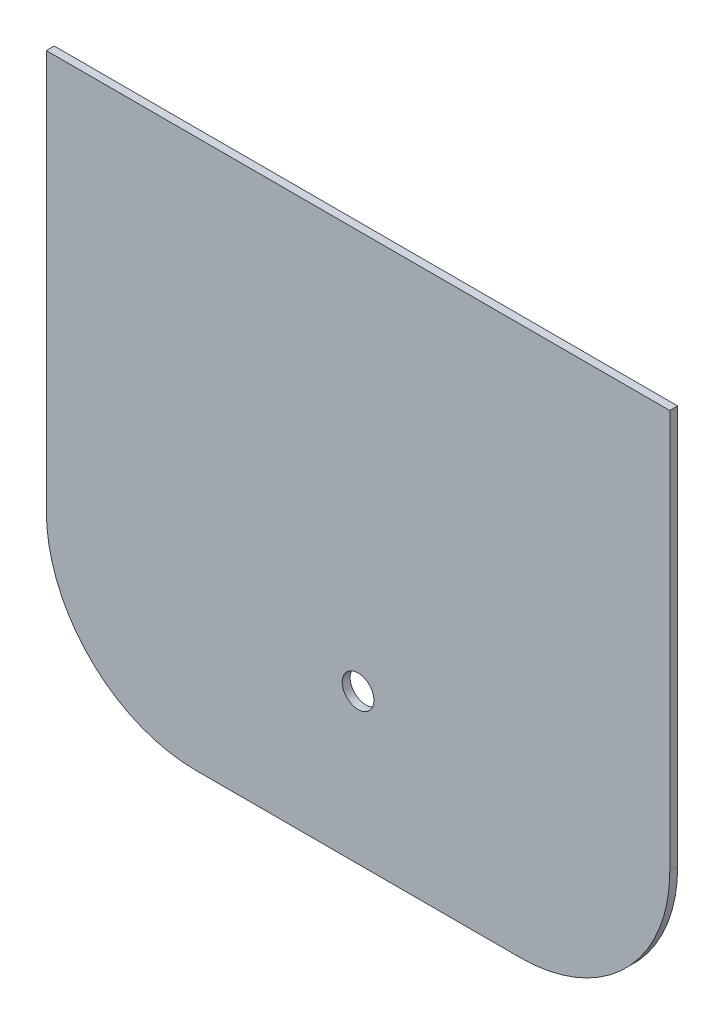
ISO-10303-21;
HEADER;
FILE_DESCRIPTION(('STEP AP214'),'2;1');
FILE_NAME('part.step','',(''),(''),'','','');
FILE_SCHEMA(('AUTOMOTIVE_DESIGN { 1 0 10303 214 1 1 1 1 }'));
ENDSEC;
DATA;
#1=APPLICATION_CONTEXT('core data for automotive mechanical design processes');
#2=APPLICATION_PROTOCOL_DEFINITION('international standard','automotive_design',2000,#1);
#3=PRODUCT_CONTEXT('',#1,'mechanical');
#4=PRODUCT('Part','Part','',(#3));
#5=PRODUCT_RELATED_PRODUCT_CATEGORY('part','',(#4));
#6=PRODUCT_DEFINITION_FORMATION('','',#4);
#7=PRODUCT_DEFINITION_CONTEXT('part definition',#1,'design');
#8=PRODUCT_DEFINITION('design','',#6,#7);
#9=PRODUCT_DEFINITION_SHAPE('','',#8);
#10=(LENGTH_UNIT() NAMED_UNIT(*) SI_UNIT(.MILLI.,.METRE.));
#11=(NAMED_UNIT(*) PLANE_ANGLE_UNIT() SI_UNIT($,.RADIAN.));
#12=(NAMED_UNIT(*) SI_UNIT($,.STERADIAN.) SOLID_ANGLE_UNIT());
#13=UNCERTAINTY_MEASURE_WITH_UNIT(LENGTH_MEASURE(1.E-05),#10,'distance_accuracy_value','');
#14=(GEOMETRIC_REPRESENTATION_CONTEXT(3) GLOBAL_UNCERTAINTY_ASSIGNED_CONTEXT((#13)) GLOBAL_UNIT_ASSIGNED_CONTEXT((#10,
#11,#12)) REPRESENTATION_CONTEXT('',''));
#15=CARTESIAN_POINT('',(0.,0.,0.));
#16=DIRECTION('',(0.,0.,1.));
#17=DIRECTION('',(1.,0.,0.));
#18=AXIS2_PLACEMENT_3D('',#15,#16,#17);
#19=CARTESIAN_POINT('',(0.,0.,3.175));
#20=DIRECTION('',(1.,0.,0.));
#21=DIRECTION('',(0.,0.,-1.));
#22=AXIS2_PLACEMENT_3D('',#19,#20,#21);
#23=PLANE('',#22);
#24=DIRECTION('',(0.,-1.,0.));
#25=VECTOR('',#24,1.);
#26=CARTESIAN_POINT('',(0.,0.,0.));
#27=LINE('',#26,#25);
#28=CARTESIAN_POINT('',(0.,220.,0.));
#29=VERTEX_POINT('',#28);
#30=CARTESIAN_POINT('',(0.,60.,0.));
#31=VERTEX_POINT('',#30);
#32=EDGE_CURVE('E120',#29,#31,#27,.T.);
#33=ORIENTED_EDGE('',*,*,#32,.T.);
#34=DIRECTION('',(0.,0.,-1.));
#35=VECTOR('',#34,1.);
#36=CARTESIAN_POINT('',(0.,60.,3.175));
#37=LINE('',#36,#35);
#38=CARTESIAN_POINT('',(0.,60.,3.175));
#39=VERTEX_POINT('',#38);
#40=EDGE_CURVE('E11',#31,#39,#37,.F.);
#41=ORIENTED_EDGE('',*,*,#40,.T.);
#42=DIRECTION('',(0.,-1.,0.));
#43=VECTOR('',#42,1.);
#44=CARTESIAN_POINT('',(0.,0.,3.175));
#45=LINE('',#44,#43);
#46=CARTESIAN_POINT('',(0.,220.,3.175));
#47=VERTEX_POINT('',#46);
#48=EDGE_CURVE('E126',#47,#39,#45,.T.);
#49=ORIENTED_EDGE('',*,*,#48,.F.);
#50=DIRECTION('',(0.,0.,-1.));
#51=VECTOR('',#50,1.);
#52=CARTESIAN_POINT('',(0.,220.,3.175));
#53=LINE('',#52,#51);
#54=EDGE_CURVE('E112',#47,#29,#53,.T.);
#55=ORIENTED_EDGE('',*,*,#54,.T.);
#56=EDGE_LOOP('',(#33,#41,#49,#55));
#57=FACE_BOUND('',#56,.T.);
#58=ADVANCED_FACE('F37',(#57),#23,.F.);
#59=CARTESIAN_POINT('',(0.,0.,3.175));
#60=DIRECTION('',(0.,1.,0.));
#61=DIRECTION('',(0.,0.,1.));
#62=AXIS2_PLACEMENT_3D('',#59,#60,#61);
#63=PLANE('',#62);
#64=DIRECTION('',(1.,0.,0.));
#65=VECTOR('',#64,1.);
#66=CARTESIAN_POINT('',(0.,0.,0.));
#67=LINE('',#66,#65);
#68=CARTESIAN_POINT('',(60.,0.,0.));
#69=VERTEX_POINT('',#68);
#70=CARTESIAN_POINT('',(190.,0.,0.));
#71=VERTEX_POINT('',#70);
#72=EDGE_CURVE('E122',#69,#71,#67,.T.);
#73=ORIENTED_EDGE('',*,*,#72,.T.);
#74=DIRECTION('',(0.,0.,-1.));
#75=VECTOR('',#74,1.);
#76=CARTESIAN_POINT('',(190.,0.,3.175));
#77=LINE('',#76,#75);
#78=CARTESIAN_POINT('',(190.,0.,3.175));
#79=VERTEX_POINT('',#78);
#80=EDGE_CURVE('E59',#71,#79,#77,.F.);
#81=ORIENTED_EDGE('',*,*,#80,.T.);
#82=DIRECTION('',(1.,0.,0.));
#83=VECTOR('',#82,1.);
#84=CARTESIAN_POINT('',(0.,0.,3.175));
#85=LINE('',#84,#83);
#86=CARTESIAN_POINT('',(60.,0.,3.175));
#87=VERTEX_POINT('',#86);
#88=EDGE_CURVE('E102',#87,#79,#85,.T.);
#89=ORIENTED_EDGE('',*,*,#88,.F.);
#90=DIRECTION('',(0.,0.,-1.));
#91=VECTOR('',#90,1.);
#92=CARTESIAN_POINT('',(60.,0.,3.175));
#93=LINE('',#92,#91);
#94=EDGE_CURVE('E133',#87,#69,#93,.T.);
#95=ORIENTED_EDGE('',*,*,#94,.T.);
#96=EDGE_LOOP('',(#73,#81,#89,#95));
#97=FACE_BOUND('',#96,.T.);
#98=ADVANCED_FACE('F142',(#97),#63,.F.);
#99=CARTESIAN_POINT('',(250.,0.,3.175));
#100=DIRECTION('',(-1.,0.,0.));
#101=DIRECTION('',(0.,0.,1.));
#102=AXIS2_PLACEMENT_3D('',#99,#100,#101);
#103=PLANE('',#102);
#104=DIRECTION('',(0.,1.,0.));
#105=VECTOR('',#104,1.);
#106=CARTESIAN_POINT('',(250.,0.,3.175));
#107=LINE('',#106,#105);
#108=CARTESIAN_POINT('',(250.,60.,3.175));
#109=VERTEX_POINT('',#108);
#110=CARTESIAN_POINT('',(250.,220.,3.175));
#111=VERTEX_POINT('',#110);
#112=EDGE_CURVE('E92',#109,#111,#107,.T.);
#113=ORIENTED_EDGE('',*,*,#112,.F.);
#114=DIRECTION('',(0.,0.,-1.));
#115=VECTOR('',#114,1.);
#116=CARTESIAN_POINT('',(250.,60.,3.175));
#117=LINE('',#116,#115);
#118=CARTESIAN_POINT('',(250.,60.,0.));
#119=VERTEX_POINT('',#118);
#120=EDGE_CURVE('E111',#109,#119,#117,.T.);
#121=ORIENTED_EDGE('',*,*,#120,.T.);
#122=DIRECTION('',(0.,1.,0.));
#123=VECTOR('',#122,1.);
#124=CARTESIAN_POINT('',(250.,0.,0.));
#125=LINE('',#124,#123);
#126=CARTESIAN_POINT('',(250.,220.,0.));
#127=VERTEX_POINT('',#126);
#128=EDGE_CURVE('E108',#119,#127,#125,.T.);
#129=ORIENTED_EDGE('',*,*,#128,.T.);
#130=DIRECTION('',(0.,0.,-1.));
#131=VECTOR('',#130,1.);
#132=CARTESIAN_POINT('',(250.,220.,3.175));
#133=LINE('',#132,#131);
#134=EDGE_CURVE('E105',#111,#127,#133,.T.);
#135=ORIENTED_EDGE('',*,*,#134,.F.);
#136=EDGE_LOOP('',(#113,#121,#129,#135));
#137=FACE_BOUND('',#136,.T.);
#138=ADVANCED_FACE('F106',(#137),#103,.F.);
#139=CARTESIAN_POINT('',(0.,220.,3.175));
#140=DIRECTION('',(0.,-1.,0.));
#141=DIRECTION('',(0.,0.,-1.));
#142=AXIS2_PLACEMENT_3D('',#139,#140,#141);
#143=PLANE('',#142);
#144=DIRECTION('',(-1.,0.,0.));
#145=VECTOR('',#144,1.);
#146=CARTESIAN_POINT('',(0.,220.,0.));
#147=LINE('',#146,#145);
#148=EDGE_CURVE('E125',#127,#29,#147,.T.);
#149=ORIENTED_EDGE('',*,*,#148,.T.);
#150=ORIENTED_EDGE('',*,*,#54,.F.);
#151=DIRECTION('',(-1.,0.,0.));
#152=VECTOR('',#151,1.);
#153=CARTESIAN_POINT('',(0.,220.,3.175));
#154=LINE('',#153,#152);
#155=EDGE_CURVE('E96',#111,#47,#154,.T.);
#156=ORIENTED_EDGE('',*,*,#155,.F.);
#157=ORIENTED_EDGE('',*,*,#134,.T.);
#158=EDGE_LOOP('',(#149,#150,#156,#157));
#159=FACE_BOUND('',#158,.T.);
#160=ADVANCED_FACE('F114',(#159),#143,.F.);
#161=CARTESIAN_POINT('',(0.,0.,3.175));
#162=DIRECTION('',(0.,0.,-1.));
#163=DIRECTION('',(-1.,0.,0.));
#164=AXIS2_PLACEMENT_3D('',#161,#162,#163);
#165=PLANE('',#164);
#166=CARTESIAN_POINT('',(125.,60.,3.175));
#167=DIRECTION('',(0.,0.,1.));
#168=DIRECTION('',(1.,0.,0.));
#169=AXIS2_PLACEMENT_3D('',#166,#167,#168);
#170=CIRCLE('',#169,6.35);
#171=CARTESIAN_POINT('',(131.35,60.,3.175));
#172=VERTEX_POINT('',#171);
#173=EDGE_CURVE('E149',#172,#172,#170,.T.);
#174=ORIENTED_EDGE('',*,*,#173,.F.);
#175=EDGE_LOOP('',(#174));
#176=FACE_BOUND('',#175,.T.);
#177=ORIENTED_EDGE('',*,*,#88,.T.);
#178=CARTESIAN_POINT('',(190.,60.,3.175));
#179=DIRECTION('',(0.,0.,-1.));
#180=DIRECTION('',(-1.,0.,0.));
#181=AXIS2_PLACEMENT_3D('',#178,#179,#180);
#182=CIRCLE('',#181,60.);
#183=EDGE_CURVE('E46',#79,#109,#182,.F.);
#184=ORIENTED_EDGE('',*,*,#183,.T.);
#185=ORIENTED_EDGE('',*,*,#112,.T.);
#186=ORIENTED_EDGE('',*,*,#155,.T.);
#187=ORIENTED_EDGE('',*,*,#48,.T.);
#188=CARTESIAN_POINT('',(60.,60.,3.175));
#189=DIRECTION('',(0.,0.,-1.));
#190=DIRECTION('',(-1.,0.,0.));
#191=AXIS2_PLACEMENT_3D('',#188,#189,#190);
#192=CIRCLE('',#191,60.);
#193=EDGE_CURVE('E137',#39,#87,#192,.F.);
#194=ORIENTED_EDGE('',*,*,#193,.T.);
#195=EDGE_LOOP('',(#177,#184,#185,#186,#187,#194));
#196=FACE_BOUND('',#195,.T.);
#197=ADVANCED_FACE('F94',(#176,#196),#165,.F.);
#198=CARTESIAN_POINT('',(0.,0.,0.));
#199=DIRECTION('',(0.,0.,-1.));
#200=DIRECTION('',(-1.,0.,0.));
#201=AXIS2_PLACEMENT_3D('',#198,#199,#200);
#202=PLANE('',#201);
#203=CARTESIAN_POINT('',(125.,60.,0.));
#204=DIRECTION('',(0.,0.,-1.));
#205=DIRECTION('',(-1.,0.,0.));
#206=AXIS2_PLACEMENT_3D('',#203,#204,#205);
#207=CIRCLE('',#206,6.35);
#208=CARTESIAN_POINT('',(118.65,60.,0.));
#209=VERTEX_POINT('',#208);
#210=EDGE_CURVE('E41',#209,#209,#207,.T.);
#211=ORIENTED_EDGE('',*,*,#210,.F.);
#212=EDGE_LOOP('',(#211));
#213=FACE_BOUND('',#212,.T.);
#214=ORIENTED_EDGE('',*,*,#128,.F.);
#215=CARTESIAN_POINT('',(190.,60.,0.));
#216=DIRECTION('',(0.,0.,-1.));
#217=DIRECTION('',(-1.,0.,0.));
#218=AXIS2_PLACEMENT_3D('',#215,#216,#217);
#219=CIRCLE('',#218,60.);
#220=EDGE_CURVE('E131',#119,#71,#219,.T.);
#221=ORIENTED_EDGE('',*,*,#220,.T.);
#222=ORIENTED_EDGE('',*,*,#72,.F.);
#223=CARTESIAN_POINT('',(60.,60.,0.));
#224=DIRECTION('',(0.,0.,-1.));
#225=DIRECTION('',(-1.,0.,0.));
#226=AXIS2_PLACEMENT_3D('',#223,#224,#225);
#227=CIRCLE('',#226,60.);
#228=EDGE_CURVE('E129',#69,#31,#227,.T.);
#229=ORIENTED_EDGE('',*,*,#228,.T.);
#230=ORIENTED_EDGE('',*,*,#32,.F.);
#231=ORIENTED_EDGE('',*,*,#148,.F.);
#232=EDGE_LOOP('',(#214,#221,#222,#229,#230,#231));
#233=FACE_BOUND('',#232,.T.);
#234=ADVANCED_FACE('F146',(#213,#233),#202,.T.);
#235=CARTESIAN_POINT('',(190.,60.,3.175));
#236=DIRECTION('',(0.,0.,-1.));
#237=DIRECTION('',(-1.,0.,0.));
#238=AXIS2_PLACEMENT_3D('',#235,#236,#237);
#239=CYLINDRICAL_SURFACE('',#238,60.);
#240=ORIENTED_EDGE('',*,*,#183,.F.);
#241=ORIENTED_EDGE('',*,*,#80,.F.);
#242=ORIENTED_EDGE('',*,*,#220,.F.);
#243=ORIENTED_EDGE('',*,*,#120,.F.);
#244=EDGE_LOOP('',(#240,#241,#242,#243));
#245=FACE_BOUND('',#244,.T.);
#246=ADVANCED_FACE('F159',(#245),#239,.T.);
#247=CARTESIAN_POINT('',(60.,60.,3.175));
#248=DIRECTION('',(0.,0.,-1.));
#249=DIRECTION('',(-1.,0.,0.));
#250=AXIS2_PLACEMENT_3D('',#247,#248,#249);
#251=CYLINDRICAL_SURFACE('',#250,60.);
#252=ORIENTED_EDGE('',*,*,#193,.F.);
#253=ORIENTED_EDGE('',*,*,#40,.F.);
#254=ORIENTED_EDGE('',*,*,#228,.F.);
#255=ORIENTED_EDGE('',*,*,#94,.F.);
#256=EDGE_LOOP('',(#252,#253,#254,#255));
#257=FACE_BOUND('',#256,.T.);
#258=ADVANCED_FACE('F39',(#257),#251,.T.);
#259=CARTESIAN_POINT('',(125.,60.,-3.175));
#260=DIRECTION('',(0.,0.,1.));
#261=DIRECTION('',(1.,0.,0.));
#262=AXIS2_PLACEMENT_3D('',#259,#260,#261);
#263=CYLINDRICAL_SURFACE('',#262,6.35);
#264=ORIENTED_EDGE('',*,*,#210,.T.);
#265=EDGE_LOOP('',(#264));
#266=FACE_BOUND('',#265,.T.);
#267=ORIENTED_EDGE('',*,*,#173,.T.);
#268=EDGE_LOOP('',(#267));
#269=FACE_BOUND('',#268,.T.);
#270=ADVANCED_FACE('F156',(#266,#269),#263,.F.);
#271=CLOSED_SHELL('',(#58,#98,#138,#160,#197,#234,#246,#258,#270));
#272=MANIFOLD_SOLID_BREP('B2',#271);
#273=ADVANCED_BREP_SHAPE_REPRESENTATION('',(#18,#272),#14);
#274=SHAPE_DEFINITION_REPRESENTATION(#9,#273);
ENDSEC;
END-ISO-10303-21;
